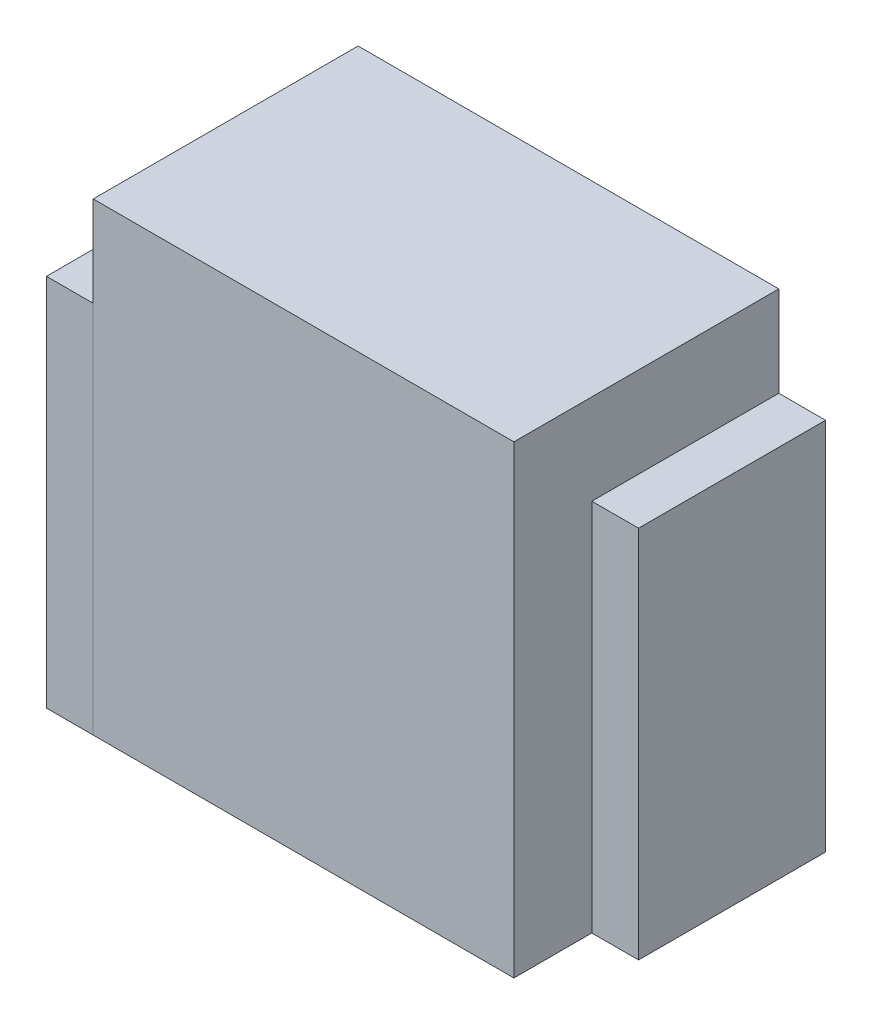
ISO-10303-21;
HEADER;
FILE_DESCRIPTION(('STEP AP214'),'2;1');
FILE_NAME('part.step','',(''),(''),'','','');
FILE_SCHEMA(('AUTOMOTIVE_DESIGN { 1 0 10303 214 1 1 1 1 }'));
ENDSEC;
DATA;
#1=APPLICATION_CONTEXT('core data for automotive mechanical design processes');
#2=APPLICATION_PROTOCOL_DEFINITION('international standard','automotive_design',2000,#1);
#3=PRODUCT_CONTEXT('',#1,'mechanical');
#4=PRODUCT('Part','Part','',(#3));
#5=PRODUCT_RELATED_PRODUCT_CATEGORY('part','',(#4));
#6=PRODUCT_DEFINITION_FORMATION('','',#4);
#7=PRODUCT_DEFINITION_CONTEXT('part definition',#1,'design');
#8=PRODUCT_DEFINITION('design','',#6,#7);
#9=PRODUCT_DEFINITION_SHAPE('','',#8);
#10=(LENGTH_UNIT() NAMED_UNIT(*) SI_UNIT(.MILLI.,.METRE.));
#11=(NAMED_UNIT(*) PLANE_ANGLE_UNIT() SI_UNIT($,.RADIAN.));
#12=(NAMED_UNIT(*) SI_UNIT($,.STERADIAN.) SOLID_ANGLE_UNIT());
#13=UNCERTAINTY_MEASURE_WITH_UNIT(LENGTH_MEASURE(1.E-05),#10,'distance_accuracy_value','');
#14=(GEOMETRIC_REPRESENTATION_CONTEXT(3) GLOBAL_UNCERTAINTY_ASSIGNED_CONTEXT((#13)) GLOBAL_UNIT_ASSIGNED_CONTEXT((#10,
#11,#12)) REPRESENTATION_CONTEXT('',''));
#15=CARTESIAN_POINT('',(0.,0.,0.));
#16=DIRECTION('',(0.,0.,1.));
#17=DIRECTION('',(1.,0.,0.));
#18=AXIS2_PLACEMENT_3D('',#15,#16,#17);
#19=CARTESIAN_POINT('',(300.,0.,-170.));
#20=DIRECTION('',(0.,0.,1.));
#21=DIRECTION('',(1.,0.,0.));
#22=AXIS2_PLACEMENT_3D('',#19,#20,#21);
#23=PLANE('',#22);
#24=DIRECTION('',(0.,1.,0.));
#25=VECTOR('',#24,1.);
#26=CARTESIAN_POINT('',(270.,0.,-170.));
#27=LINE('',#26,#25);
#28=CARTESIAN_POINT('',(270.,0.,-170.));
#29=VERTEX_POINT('',#28);
#30=CARTESIAN_POINT('',(270.,240.,-170.));
#31=VERTEX_POINT('',#30);
#32=EDGE_CURVE('E109',#29,#31,#27,.T.);
#33=ORIENTED_EDGE('',*,*,#32,.T.);
#34=DIRECTION('',(-1.,0.,0.));
#35=VECTOR('',#34,1.);
#36=CARTESIAN_POINT('',(300.,240.,-170.));
#37=LINE('',#36,#35);
#38=CARTESIAN_POINT('',(300.,240.,-170.));
#39=VERTEX_POINT('',#38);
#40=EDGE_CURVE('E12',#39,#31,#37,.T.);
#41=ORIENTED_EDGE('',*,*,#40,.F.);
#42=DIRECTION('',(0.,1.,0.));
#43=VECTOR('',#42,1.);
#44=CARTESIAN_POINT('',(300.,0.,-170.));
#45=LINE('',#44,#43);
#46=CARTESIAN_POINT('',(300.,0.,-170.));
#47=VERTEX_POINT('',#46);
#48=EDGE_CURVE('E97',#47,#39,#45,.T.);
#49=ORIENTED_EDGE('',*,*,#48,.F.);
#50=DIRECTION('',(-1.,0.,0.));
#51=VECTOR('',#50,1.);
#52=CARTESIAN_POINT('',(300.,0.,-170.));
#53=LINE('',#52,#51);
#54=EDGE_CURVE('E105',#47,#29,#53,.T.);
#55=ORIENTED_EDGE('',*,*,#54,.T.);
#56=EDGE_LOOP('',(#33,#41,#49,#55));
#57=FACE_BOUND('',#56,.T.);
#58=ADVANCED_FACE('F46',(#57),#23,.F.);
#59=CARTESIAN_POINT('',(300.,240.,-170.));
#60=DIRECTION('',(0.,-1.,0.));
#61=DIRECTION('',(0.,0.,-1.));
#62=AXIS2_PLACEMENT_3D('',#59,#60,#61);
#63=PLANE('',#62);
#64=DIRECTION('',(0.,0.,1.));
#65=VECTOR('',#64,1.);
#66=CARTESIAN_POINT('',(270.,240.,-170.));
#67=LINE('',#66,#65);
#68=CARTESIAN_POINT('',(270.,240.,-50.));
#69=VERTEX_POINT('',#68);
#70=EDGE_CURVE('E101',#31,#69,#67,.T.);
#71=ORIENTED_EDGE('',*,*,#70,.T.);
#72=DIRECTION('',(-1.,0.,0.));
#73=VECTOR('',#72,1.);
#74=CARTESIAN_POINT('',(300.,240.,-50.));
#75=LINE('',#74,#73);
#76=CARTESIAN_POINT('',(300.,240.,-50.));
#77=VERTEX_POINT('',#76);
#78=EDGE_CURVE('E54',#77,#69,#75,.T.);
#79=ORIENTED_EDGE('',*,*,#78,.F.);
#80=DIRECTION('',(0.,0.,1.));
#81=VECTOR('',#80,1.);
#82=CARTESIAN_POINT('',(300.,240.,-170.));
#83=LINE('',#82,#81);
#84=EDGE_CURVE('E92',#39,#77,#83,.T.);
#85=ORIENTED_EDGE('',*,*,#84,.F.);
#86=ORIENTED_EDGE('',*,*,#40,.T.);
#87=EDGE_LOOP('',(#71,#79,#85,#86));
#88=FACE_BOUND('',#87,.T.);
#89=ADVANCED_FACE('F100',(#88),#63,.F.);
#90=CARTESIAN_POINT('',(300.,0.,-50.));
#91=DIRECTION('',(0.,0.,-1.));
#92=DIRECTION('',(-1.,0.,0.));
#93=AXIS2_PLACEMENT_3D('',#90,#91,#92);
#94=PLANE('',#93);
#95=DIRECTION('',(0.,-1.,0.));
#96=VECTOR('',#95,1.);
#97=CARTESIAN_POINT('',(270.,0.,-50.));
#98=LINE('',#97,#96);
#99=CARTESIAN_POINT('',(270.,0.,-50.));
#100=VERTEX_POINT('',#99);
#101=EDGE_CURVE('E79',#69,#100,#98,.T.);
#102=ORIENTED_EDGE('',*,*,#101,.T.);
#103=DIRECTION('',(-1.,0.,0.));
#104=VECTOR('',#103,1.);
#105=CARTESIAN_POINT('',(300.,0.,-50.));
#106=LINE('',#105,#104);
#107=CARTESIAN_POINT('',(300.,0.,-50.));
#108=VERTEX_POINT('',#107);
#109=EDGE_CURVE('E102',#108,#100,#106,.T.);
#110=ORIENTED_EDGE('',*,*,#109,.F.);
#111=DIRECTION('',(0.,-1.,0.));
#112=VECTOR('',#111,1.);
#113=CARTESIAN_POINT('',(300.,0.,-50.));
#114=LINE('',#113,#112);
#115=EDGE_CURVE('E95',#77,#108,#114,.T.);
#116=ORIENTED_EDGE('',*,*,#115,.F.);
#117=ORIENTED_EDGE('',*,*,#78,.T.);
#118=EDGE_LOOP('',(#102,#110,#116,#117));
#119=FACE_BOUND('',#118,.T.);
#120=ADVANCED_FACE('F103',(#119),#94,.F.);
#121=CARTESIAN_POINT('',(300.,0.,-170.));
#122=DIRECTION('',(0.,1.,0.));
#123=DIRECTION('',(0.,0.,1.));
#124=AXIS2_PLACEMENT_3D('',#121,#122,#123);
#125=PLANE('',#124);
#126=DIRECTION('',(0.,0.,-1.));
#127=VECTOR('',#126,1.);
#128=CARTESIAN_POINT('',(270.,0.,-170.));
#129=LINE('',#128,#127);
#130=EDGE_CURVE('E85',#100,#29,#129,.T.);
#131=ORIENTED_EDGE('',*,*,#130,.T.);
#132=ORIENTED_EDGE('',*,*,#54,.F.);
#133=DIRECTION('',(0.,0.,-1.));
#134=VECTOR('',#133,1.);
#135=CARTESIAN_POINT('',(300.,0.,-170.));
#136=LINE('',#135,#134);
#137=EDGE_CURVE('E62',#108,#47,#136,.T.);
#138=ORIENTED_EDGE('',*,*,#137,.F.);
#139=ORIENTED_EDGE('',*,*,#109,.T.);
#140=EDGE_LOOP('',(#131,#132,#138,#139));
#141=FACE_BOUND('',#140,.T.);
#142=ADVANCED_FACE('F116',(#141),#125,.F.);
#143=CARTESIAN_POINT('',(300.,0.,0.));
#144=DIRECTION('',(1.,0.,0.));
#145=DIRECTION('',(0.,0.,-1.));
#146=AXIS2_PLACEMENT_3D('',#143,#144,#145);
#147=PLANE('',#146);
#148=ORIENTED_EDGE('',*,*,#48,.T.);
#149=ORIENTED_EDGE('',*,*,#84,.T.);
#150=ORIENTED_EDGE('',*,*,#115,.T.);
#151=ORIENTED_EDGE('',*,*,#137,.T.);
#152=EDGE_LOOP('',(#148,#149,#150,#151));
#153=FACE_BOUND('',#152,.T.);
#154=ADVANCED_FACE('F93',(#153),#147,.T.);
#155=CARTESIAN_POINT('',(270.,0.,0.));
#156=DIRECTION('',(1.,0.,0.));
#157=DIRECTION('',(0.,0.,-1.));
#158=AXIS2_PLACEMENT_3D('',#155,#156,#157);
#159=PLANE('',#158);
#160=ORIENTED_EDGE('',*,*,#32,.F.);
#161=ORIENTED_EDGE('',*,*,#130,.F.);
#162=ORIENTED_EDGE('',*,*,#101,.F.);
#163=ORIENTED_EDGE('',*,*,#70,.F.);
#164=EDGE_LOOP('',(#160,#161,#162,#163));
#165=FACE_BOUND('',#164,.T.);
#166=ADVANCED_FACE('F119',(#165),#159,.F.);
#167=CLOSED_SHELL('',(#58,#89,#120,#142,#154,#166));
#168=MANIFOLD_SOLID_BREP('B2',#167);
#169=CARTESIAN_POINT('',(-30.,240.,-45.));
#170=DIRECTION('',(0.,0.,1.));
#171=DIRECTION('',(0.,-1.,0.));
#172=AXIS2_PLACEMENT_3D('',#169,#170,#171);
#173=PLANE('',#172);
#174=DIRECTION('',(0.,-1.,0.));
#175=VECTOR('',#174,1.);
#176=CARTESIAN_POINT('',(0.,240.,-45.));
#177=LINE('',#176,#175);
#178=CARTESIAN_POINT('',(0.,240.,-45.));
#179=VERTEX_POINT('',#178);
#180=CARTESIAN_POINT('',(0.,0.,-45.));
#181=VERTEX_POINT('',#180);
#182=EDGE_CURVE('E243',#179,#181,#177,.T.);
#183=ORIENTED_EDGE('',*,*,#182,.T.);
#184=DIRECTION('',(1.,0.,0.));
#185=VECTOR('',#184,1.);
#186=CARTESIAN_POINT('',(-30.,0.,-45.));
#187=LINE('',#186,#185);
#188=CARTESIAN_POINT('',(-30.,0.,-45.));
#189=VERTEX_POINT('',#188);
#190=EDGE_CURVE('E44',#189,#181,#187,.T.);
#191=ORIENTED_EDGE('',*,*,#190,.F.);
#192=DIRECTION('',(0.,-1.,0.));
#193=VECTOR('',#192,1.);
#194=CARTESIAN_POINT('',(-30.,240.,-45.));
#195=LINE('',#194,#193);
#196=CARTESIAN_POINT('',(-30.,240.,-45.));
#197=VERTEX_POINT('',#196);
#198=EDGE_CURVE('E231',#197,#189,#195,.T.);
#199=ORIENTED_EDGE('',*,*,#198,.F.);
#200=DIRECTION('',(1.,0.,0.));
#201=VECTOR('',#200,1.);
#202=CARTESIAN_POINT('',(-30.,240.,-45.));
#203=LINE('',#202,#201);
#204=EDGE_CURVE('E239',#197,#179,#203,.T.);
#205=ORIENTED_EDGE('',*,*,#204,.T.);
#206=EDGE_LOOP('',(#183,#191,#199,#205));
#207=FACE_BOUND('',#206,.T.);
#208=ADVANCED_FACE('F180',(#207),#173,.F.);
#209=CARTESIAN_POINT('',(-30.,0.,-45.));
#210=DIRECTION('',(0.,1.,0.));
#211=DIRECTION('',(0.,0.,1.));
#212=AXIS2_PLACEMENT_3D('',#209,#210,#211);
#213=PLANE('',#212);
#214=DIRECTION('',(0.,0.,1.));
#215=VECTOR('',#214,1.);
#216=CARTESIAN_POINT('',(0.,0.,-45.));
#217=LINE('',#216,#215);
#218=CARTESIAN_POINT('',(0.,0.,0.));
#219=VERTEX_POINT('',#218);
#220=EDGE_CURVE('E235',#181,#219,#217,.T.);
#221=ORIENTED_EDGE('',*,*,#220,.T.);
#222=DIRECTION('',(1.,0.,0.));
#223=VECTOR('',#222,1.);
#224=CARTESIAN_POINT('',(-30.,0.,0.));
#225=LINE('',#224,#223);
#226=CARTESIAN_POINT('',(-30.,0.,0.));
#227=VERTEX_POINT('',#226);
#228=EDGE_CURVE('E188',#227,#219,#225,.T.);
#229=ORIENTED_EDGE('',*,*,#228,.F.);
#230=DIRECTION('',(0.,0.,1.));
#231=VECTOR('',#230,1.);
#232=CARTESIAN_POINT('',(-30.,0.,-45.));
#233=LINE('',#232,#231);
#234=EDGE_CURVE('E226',#189,#227,#233,.T.);
#235=ORIENTED_EDGE('',*,*,#234,.F.);
#236=ORIENTED_EDGE('',*,*,#190,.T.);
#237=EDGE_LOOP('',(#221,#229,#235,#236));
#238=FACE_BOUND('',#237,.T.);
#239=ADVANCED_FACE('F234',(#238),#213,.F.);
#240=CARTESIAN_POINT('',(-30.,240.,0.));
#241=DIRECTION('',(0.,0.,-1.));
#242=DIRECTION('',(-1.,0.,0.));
#243=AXIS2_PLACEMENT_3D('',#240,#241,#242);
#244=PLANE('',#243);
#245=DIRECTION('',(0.,1.,0.));
#246=VECTOR('',#245,1.);
#247=CARTESIAN_POINT('',(0.,240.,0.));
#248=LINE('',#247,#246);
#249=CARTESIAN_POINT('',(0.,240.,0.));
#250=VERTEX_POINT('',#249);
#251=EDGE_CURVE('E213',#219,#250,#248,.T.);
#252=ORIENTED_EDGE('',*,*,#251,.T.);
#253=DIRECTION('',(1.,0.,0.));
#254=VECTOR('',#253,1.);
#255=CARTESIAN_POINT('',(-30.,240.,0.));
#256=LINE('',#255,#254);
#257=CARTESIAN_POINT('',(-30.,240.,0.));
#258=VERTEX_POINT('',#257);
#259=EDGE_CURVE('E236',#258,#250,#256,.T.);
#260=ORIENTED_EDGE('',*,*,#259,.F.);
#261=DIRECTION('',(0.,1.,0.));
#262=VECTOR('',#261,1.);
#263=CARTESIAN_POINT('',(-30.,240.,0.));
#264=LINE('',#263,#262);
#265=EDGE_CURVE('E229',#227,#258,#264,.T.);
#266=ORIENTED_EDGE('',*,*,#265,.F.);
#267=ORIENTED_EDGE('',*,*,#228,.T.);
#268=EDGE_LOOP('',(#252,#260,#266,#267));
#269=FACE_BOUND('',#268,.T.);
#270=ADVANCED_FACE('F237',(#269),#244,.F.);
#271=CARTESIAN_POINT('',(-30.,240.,-45.));
#272=DIRECTION('',(0.,-1.,0.));
#273=DIRECTION('',(0.,0.,-1.));
#274=AXIS2_PLACEMENT_3D('',#271,#272,#273);
#275=PLANE('',#274);
#276=DIRECTION('',(0.,0.,-1.));
#277=VECTOR('',#276,1.);
#278=CARTESIAN_POINT('',(0.,240.,-45.));
#279=LINE('',#278,#277);
#280=EDGE_CURVE('E219',#250,#179,#279,.T.);
#281=ORIENTED_EDGE('',*,*,#280,.T.);
#282=ORIENTED_EDGE('',*,*,#204,.F.);
#283=DIRECTION('',(0.,0.,-1.));
#284=VECTOR('',#283,1.);
#285=CARTESIAN_POINT('',(-30.,240.,-45.));
#286=LINE('',#285,#284);
#287=EDGE_CURVE('E196',#258,#197,#286,.T.);
#288=ORIENTED_EDGE('',*,*,#287,.F.);
#289=ORIENTED_EDGE('',*,*,#259,.T.);
#290=EDGE_LOOP('',(#281,#282,#288,#289));
#291=FACE_BOUND('',#290,.T.);
#292=ADVANCED_FACE('F250',(#291),#275,.F.);
#293=CARTESIAN_POINT('',(-30.,0.,0.));
#294=DIRECTION('',(-1.,0.,0.));
#295=DIRECTION('',(0.,0.,1.));
#296=AXIS2_PLACEMENT_3D('',#293,#294,#295);
#297=PLANE('',#296);
#298=ORIENTED_EDGE('',*,*,#198,.T.);
#299=ORIENTED_EDGE('',*,*,#234,.T.);
#300=ORIENTED_EDGE('',*,*,#265,.T.);
#301=ORIENTED_EDGE('',*,*,#287,.T.);
#302=EDGE_LOOP('',(#298,#299,#300,#301));
#303=FACE_BOUND('',#302,.T.);
#304=ADVANCED_FACE('F227',(#303),#297,.T.);
#305=CARTESIAN_POINT('',(0.,0.,0.));
#306=DIRECTION('',(-1.,0.,0.));
#307=DIRECTION('',(0.,0.,1.));
#308=AXIS2_PLACEMENT_3D('',#305,#306,#307);
#309=PLANE('',#308);
#310=ORIENTED_EDGE('',*,*,#182,.F.);
#311=ORIENTED_EDGE('',*,*,#280,.F.);
#312=ORIENTED_EDGE('',*,*,#251,.F.);
#313=ORIENTED_EDGE('',*,*,#220,.F.);
#314=EDGE_LOOP('',(#310,#311,#312,#313));
#315=FACE_BOUND('',#314,.T.);
#316=ADVANCED_FACE('F253',(#315),#309,.F.);
#317=CLOSED_SHELL('',(#208,#239,#270,#292,#304,#316));
#318=MANIFOLD_SOLID_BREP('B6',#317);
#319=CARTESIAN_POINT('',(-30.,0.,-170.));
#320=DIRECTION('',(0.,0.,1.));
#321=DIRECTION('',(1.,0.,0.));
#322=AXIS2_PLACEMENT_3D('',#319,#320,#321);
#323=PLANE('',#322);
#324=DIRECTION('',(0.,-1.,0.));
#325=VECTOR('',#324,1.);
#326=CARTESIAN_POINT('',(0.,0.,-170.));
#327=LINE('',#326,#325);
#328=CARTESIAN_POINT('',(0.,240.,-170.));
#329=VERTEX_POINT('',#328);
#330=CARTESIAN_POINT('',(0.,0.,-170.));
#331=VERTEX_POINT('',#330);
#332=EDGE_CURVE('E376',#329,#331,#327,.T.);
#333=ORIENTED_EDGE('',*,*,#332,.T.);
#334=DIRECTION('',(1.,0.,0.));
#335=VECTOR('',#334,1.);
#336=CARTESIAN_POINT('',(-30.,0.,-170.));
#337=LINE('',#336,#335);
#338=CARTESIAN_POINT('',(-30.,0.,-170.));
#339=VERTEX_POINT('',#338);
#340=EDGE_CURVE('E178',#339,#331,#337,.T.);
#341=ORIENTED_EDGE('',*,*,#340,.F.);
#342=DIRECTION('',(0.,-1.,0.));
#343=VECTOR('',#342,1.);
#344=CARTESIAN_POINT('',(-30.,0.,-170.));
#345=LINE('',#344,#343);
#346=CARTESIAN_POINT('',(-30.,240.,-170.));
#347=VERTEX_POINT('',#346);
#348=EDGE_CURVE('E364',#347,#339,#345,.T.);
#349=ORIENTED_EDGE('',*,*,#348,.F.);
#350=DIRECTION('',(1.,0.,0.));
#351=VECTOR('',#350,1.);
#352=CARTESIAN_POINT('',(-30.,240.,-170.));
#353=LINE('',#352,#351);
#354=EDGE_CURVE('E372',#347,#329,#353,.T.);
#355=ORIENTED_EDGE('',*,*,#354,.T.);
#356=EDGE_LOOP('',(#333,#341,#349,#355));
#357=FACE_BOUND('',#356,.T.);
#358=ADVANCED_FACE('F313',(#357),#323,.F.);
#359=CARTESIAN_POINT('',(-30.,0.,-170.));
#360=DIRECTION('',(0.,1.,0.));
#361=DIRECTION('',(0.,0.,1.));
#362=AXIS2_PLACEMENT_3D('',#359,#360,#361);
#363=PLANE('',#362);
#364=DIRECTION('',(0.,0.,1.));
#365=VECTOR('',#364,1.);
#366=CARTESIAN_POINT('',(0.,0.,-170.));
#367=LINE('',#366,#365);
#368=CARTESIAN_POINT('',(0.,0.,-50.));
#369=VERTEX_POINT('',#368);
#370=EDGE_CURVE('E368',#331,#369,#367,.T.);
#371=ORIENTED_EDGE('',*,*,#370,.T.);
#372=DIRECTION('',(1.,0.,0.));
#373=VECTOR('',#372,1.);
#374=CARTESIAN_POINT('',(-30.,0.,-50.));
#375=LINE('',#374,#373);
#376=CARTESIAN_POINT('',(-30.,0.,-50.));
#377=VERTEX_POINT('',#376);
#378=EDGE_CURVE('E321',#377,#369,#375,.T.);
#379=ORIENTED_EDGE('',*,*,#378,.F.);
#380=DIRECTION('',(0.,0.,1.));
#381=VECTOR('',#380,1.);
#382=CARTESIAN_POINT('',(-30.,0.,-170.));
#383=LINE('',#382,#381);
#384=EDGE_CURVE('E359',#339,#377,#383,.T.);
#385=ORIENTED_EDGE('',*,*,#384,.F.);
#386=ORIENTED_EDGE('',*,*,#340,.T.);
#387=EDGE_LOOP('',(#371,#379,#385,#386));
#388=FACE_BOUND('',#387,.T.);
#389=ADVANCED_FACE('F367',(#388),#363,.F.);
#390=CARTESIAN_POINT('',(-30.,0.,-50.));
#391=DIRECTION('',(0.,0.,-1.));
#392=DIRECTION('',(-1.,0.,0.));
#393=AXIS2_PLACEMENT_3D('',#390,#391,#392);
#394=PLANE('',#393);
#395=DIRECTION('',(0.,1.,0.));
#396=VECTOR('',#395,1.);
#397=CARTESIAN_POINT('',(0.,0.,-50.));
#398=LINE('',#397,#396);
#399=CARTESIAN_POINT('',(0.,240.,-50.));
#400=VERTEX_POINT('',#399);
#401=EDGE_CURVE('E346',#369,#400,#398,.T.);
#402=ORIENTED_EDGE('',*,*,#401,.T.);
#403=DIRECTION('',(1.,0.,0.));
#404=VECTOR('',#403,1.);
#405=CARTESIAN_POINT('',(-30.,240.,-50.));
#406=LINE('',#405,#404);
#407=CARTESIAN_POINT('',(-30.,240.,-50.));
#408=VERTEX_POINT('',#407);
#409=EDGE_CURVE('E369',#408,#400,#406,.T.);
#410=ORIENTED_EDGE('',*,*,#409,.F.);
#411=DIRECTION('',(0.,1.,0.));
#412=VECTOR('',#411,1.);
#413=CARTESIAN_POINT('',(-30.,0.,-50.));
#414=LINE('',#413,#412);
#415=EDGE_CURVE('E362',#377,#408,#414,.T.);
#416=ORIENTED_EDGE('',*,*,#415,.F.);
#417=ORIENTED_EDGE('',*,*,#378,.T.);
#418=EDGE_LOOP('',(#402,#410,#416,#417));
#419=FACE_BOUND('',#418,.T.);
#420=ADVANCED_FACE('F370',(#419),#394,.F.);
#421=CARTESIAN_POINT('',(-30.,240.,-170.));
#422=DIRECTION('',(0.,-1.,0.));
#423=DIRECTION('',(0.,0.,-1.));
#424=AXIS2_PLACEMENT_3D('',#421,#422,#423);
#425=PLANE('',#424);
#426=DIRECTION('',(0.,0.,-1.));
#427=VECTOR('',#426,1.);
#428=CARTESIAN_POINT('',(0.,240.,-170.));
#429=LINE('',#428,#427);
#430=EDGE_CURVE('E352',#400,#329,#429,.T.);
#431=ORIENTED_EDGE('',*,*,#430,.T.);
#432=ORIENTED_EDGE('',*,*,#354,.F.);
#433=DIRECTION('',(0.,0.,-1.));
#434=VECTOR('',#433,1.);
#435=CARTESIAN_POINT('',(-30.,240.,-170.));
#436=LINE('',#435,#434);
#437=EDGE_CURVE('E329',#408,#347,#436,.T.);
#438=ORIENTED_EDGE('',*,*,#437,.F.);
#439=ORIENTED_EDGE('',*,*,#409,.T.);
#440=EDGE_LOOP('',(#431,#432,#438,#439));
#441=FACE_BOUND('',#440,.T.);
#442=ADVANCED_FACE('F383',(#441),#425,.F.);
#443=CARTESIAN_POINT('',(-30.,0.,0.));
#444=DIRECTION('',(1.,0.,0.));
#445=DIRECTION('',(0.,0.,-1.));
#446=AXIS2_PLACEMENT_3D('',#443,#444,#445);
#447=PLANE('',#446);
#448=ORIENTED_EDGE('',*,*,#348,.T.);
#449=ORIENTED_EDGE('',*,*,#384,.T.);
#450=ORIENTED_EDGE('',*,*,#415,.T.);
#451=ORIENTED_EDGE('',*,*,#437,.T.);
#452=EDGE_LOOP('',(#448,#449,#450,#451));
#453=FACE_BOUND('',#452,.T.);
#454=ADVANCED_FACE('F360',(#453),#447,.F.);
#455=CARTESIAN_POINT('',(0.,0.,0.));
#456=DIRECTION('',(1.,0.,0.));
#457=DIRECTION('',(0.,0.,-1.));
#458=AXIS2_PLACEMENT_3D('',#455,#456,#457);
#459=PLANE('',#458);
#460=ORIENTED_EDGE('',*,*,#332,.F.);
#461=ORIENTED_EDGE('',*,*,#430,.F.);
#462=ORIENTED_EDGE('',*,*,#401,.F.);
#463=ORIENTED_EDGE('',*,*,#370,.F.);
#464=EDGE_LOOP('',(#460,#461,#462,#463));
#465=FACE_BOUND('',#464,.T.);
#466=ADVANCED_FACE('F386',(#465),#459,.T.);
#467=CLOSED_SHELL('',(#358,#389,#420,#442,#454,#466));
#468=MANIFOLD_SOLID_BREP('B38',#467);
#469=CARTESIAN_POINT('',(0.,298.,0.));
#470=DIRECTION('',(1.,0.,0.));
#471=DIRECTION('',(0.,0.,-1.));
#472=AXIS2_PLACEMENT_3D('',#469,#470,#471);
#473=PLANE('',#472);
#474=DIRECTION('',(0.,0.,1.));
#475=VECTOR('',#474,1.);
#476=CARTESIAN_POINT('',(0.,0.,0.));
#477=LINE('',#476,#475);
#478=CARTESIAN_POINT('',(0.,0.,-170.));
#479=VERTEX_POINT('',#478);
#480=CARTESIAN_POINT('',(0.,0.,0.));
#481=VERTEX_POINT('',#480);
#482=EDGE_CURVE('E504',#479,#481,#477,.T.);
#483=ORIENTED_EDGE('',*,*,#482,.T.);
#484=DIRECTION('',(0.,-1.,0.));
#485=VECTOR('',#484,1.);
#486=CARTESIAN_POINT('',(0.,298.,0.));
#487=LINE('',#486,#485);
#488=CARTESIAN_POINT('',(0.,298.,0.));
#489=VERTEX_POINT('',#488);
#490=EDGE_CURVE('E311',#489,#481,#487,.T.);
#491=ORIENTED_EDGE('',*,*,#490,.F.);
#492=DIRECTION('',(0.,0.,1.));
#493=VECTOR('',#492,1.);
#494=CARTESIAN_POINT('',(0.,298.,0.));
#495=LINE('',#494,#493);
#496=CARTESIAN_POINT('',(0.,298.,-170.));
#497=VERTEX_POINT('',#496);
#498=EDGE_CURVE('E492',#497,#489,#495,.T.);
#499=ORIENTED_EDGE('',*,*,#498,.F.);
#500=DIRECTION('',(0.,-1.,0.));
#501=VECTOR('',#500,1.);
#502=CARTESIAN_POINT('',(0.,298.,-170.));
#503=LINE('',#502,#501);
#504=EDGE_CURVE('E500',#497,#479,#503,.T.);
#505=ORIENTED_EDGE('',*,*,#504,.T.);
#506=EDGE_LOOP('',(#483,#491,#499,#505));
#507=FACE_BOUND('',#506,.T.);
#508=ADVANCED_FACE('F441',(#507),#473,.F.);
#509=CARTESIAN_POINT('',(0.,298.,0.));
#510=DIRECTION('',(0.,0.,-1.));
#511=DIRECTION('',(-1.,0.,0.));
#512=AXIS2_PLACEMENT_3D('',#509,#510,#511);
#513=PLANE('',#512);
#514=DIRECTION('',(1.,0.,0.));
#515=VECTOR('',#514,1.);
#516=CARTESIAN_POINT('',(0.,0.,0.));
#517=LINE('',#516,#515);
#518=CARTESIAN_POINT('',(270.,0.,0.));
#519=VERTEX_POINT('',#518);
#520=EDGE_CURVE('E496',#481,#519,#517,.T.);
#521=ORIENTED_EDGE('',*,*,#520,.T.);
#522=DIRECTION('',(0.,-1.,0.));
#523=VECTOR('',#522,1.);
#524=CARTESIAN_POINT('',(270.,298.,0.));
#525=LINE('',#524,#523);
#526=CARTESIAN_POINT('',(270.,298.,0.));
#527=VERTEX_POINT('',#526);
#528=EDGE_CURVE('E449',#527,#519,#525,.T.);
#529=ORIENTED_EDGE('',*,*,#528,.F.);
#530=DIRECTION('',(1.,0.,0.));
#531=VECTOR('',#530,1.);
#532=CARTESIAN_POINT('',(0.,298.,0.));
#533=LINE('',#532,#531);
#534=EDGE_CURVE('E487',#489,#527,#533,.T.);
#535=ORIENTED_EDGE('',*,*,#534,.F.);
#536=ORIENTED_EDGE('',*,*,#490,.T.);
#537=EDGE_LOOP('',(#521,#529,#535,#536));
#538=FACE_BOUND('',#537,.T.);
#539=ADVANCED_FACE('F495',(#538),#513,.F.);
#540=CARTESIAN_POINT('',(270.,298.,0.));
#541=DIRECTION('',(-1.,0.,0.));
#542=DIRECTION('',(0.,0.,1.));
#543=AXIS2_PLACEMENT_3D('',#540,#541,#542);
#544=PLANE('',#543);
#545=DIRECTION('',(0.,0.,-1.));
#546=VECTOR('',#545,1.);
#547=CARTESIAN_POINT('',(270.,0.,0.));
#548=LINE('',#547,#546);
#549=CARTESIAN_POINT('',(270.,0.,-170.));
#550=VERTEX_POINT('',#549);
#551=EDGE_CURVE('E474',#519,#550,#548,.T.);
#552=ORIENTED_EDGE('',*,*,#551,.T.);
#553=DIRECTION('',(0.,-1.,0.));
#554=VECTOR('',#553,1.);
#555=CARTESIAN_POINT('',(270.,298.,-170.));
#556=LINE('',#555,#554);
#557=CARTESIAN_POINT('',(270.,298.,-170.));
#558=VERTEX_POINT('',#557);
#559=EDGE_CURVE('E497',#558,#550,#556,.T.);
#560=ORIENTED_EDGE('',*,*,#559,.F.);
#561=DIRECTION('',(0.,0.,-1.));
#562=VECTOR('',#561,1.);
#563=CARTESIAN_POINT('',(270.,298.,0.));
#564=LINE('',#563,#562);
#565=EDGE_CURVE('E490',#527,#558,#564,.T.);
#566=ORIENTED_EDGE('',*,*,#565,.F.);
#567=ORIENTED_EDGE('',*,*,#528,.T.);
#568=EDGE_LOOP('',(#552,#560,#566,#567));
#569=FACE_BOUND('',#568,.T.);
#570=ADVANCED_FACE('F498',(#569),#544,.F.);
#571=CARTESIAN_POINT('',(0.,298.,-170.));
#572=DIRECTION('',(0.,0.,1.));
#573=DIRECTION('',(1.,0.,0.));
#574=AXIS2_PLACEMENT_3D('',#571,#572,#573);
#575=PLANE('',#574);
#576=DIRECTION('',(-1.,0.,0.));
#577=VECTOR('',#576,1.);
#578=CARTESIAN_POINT('',(0.,0.,-170.));
#579=LINE('',#578,#577);
#580=EDGE_CURVE('E480',#550,#479,#579,.T.);
#581=ORIENTED_EDGE('',*,*,#580,.T.);
#582=ORIENTED_EDGE('',*,*,#504,.F.);
#583=DIRECTION('',(-1.,0.,0.));
#584=VECTOR('',#583,1.);
#585=CARTESIAN_POINT('',(0.,298.,-170.));
#586=LINE('',#585,#584);
#587=EDGE_CURVE('E457',#558,#497,#586,.T.);
#588=ORIENTED_EDGE('',*,*,#587,.F.);
#589=ORIENTED_EDGE('',*,*,#559,.T.);
#590=EDGE_LOOP('',(#581,#582,#588,#589));
#591=FACE_BOUND('',#590,.T.);
#592=ADVANCED_FACE('F511',(#591),#575,.F.);
#593=CARTESIAN_POINT('',(0.,298.,0.));
#594=DIRECTION('',(0.,-1.,0.));
#595=DIRECTION('',(0.,0.,-1.));
#596=AXIS2_PLACEMENT_3D('',#593,#594,#595);
#597=PLANE('',#596);
#598=ORIENTED_EDGE('',*,*,#498,.T.);
#599=ORIENTED_EDGE('',*,*,#534,.T.);
#600=ORIENTED_EDGE('',*,*,#565,.T.);
#601=ORIENTED_EDGE('',*,*,#587,.T.);
#602=EDGE_LOOP('',(#598,#599,#600,#601));
#603=FACE_BOUND('',#602,.T.);
#604=ADVANCED_FACE('F488',(#603),#597,.F.);
#605=CARTESIAN_POINT('',(0.,0.,0.));
#606=DIRECTION('',(0.,-1.,0.));
#607=DIRECTION('',(0.,0.,-1.));
#608=AXIS2_PLACEMENT_3D('',#605,#606,#607);
#609=PLANE('',#608);
#610=ORIENTED_EDGE('',*,*,#482,.F.);
#611=ORIENTED_EDGE('',*,*,#580,.F.);
#612=ORIENTED_EDGE('',*,*,#551,.F.);
#613=ORIENTED_EDGE('',*,*,#520,.F.);
#614=EDGE_LOOP('',(#610,#611,#612,#613));
#615=FACE_BOUND('',#614,.T.);
#616=ADVANCED_FACE('F514',(#615),#609,.T.);
#617=CLOSED_SHELL('',(#508,#539,#570,#592,#604,#616));
#618=MANIFOLD_SOLID_BREP('B172',#617);
#619=ADVANCED_BREP_SHAPE_REPRESENTATION('',(#18,#168,#318,#468,#618),#14);
#620=SHAPE_DEFINITION_REPRESENTATION(#9,#619);
ENDSEC;
END-ISO-10303-21;
